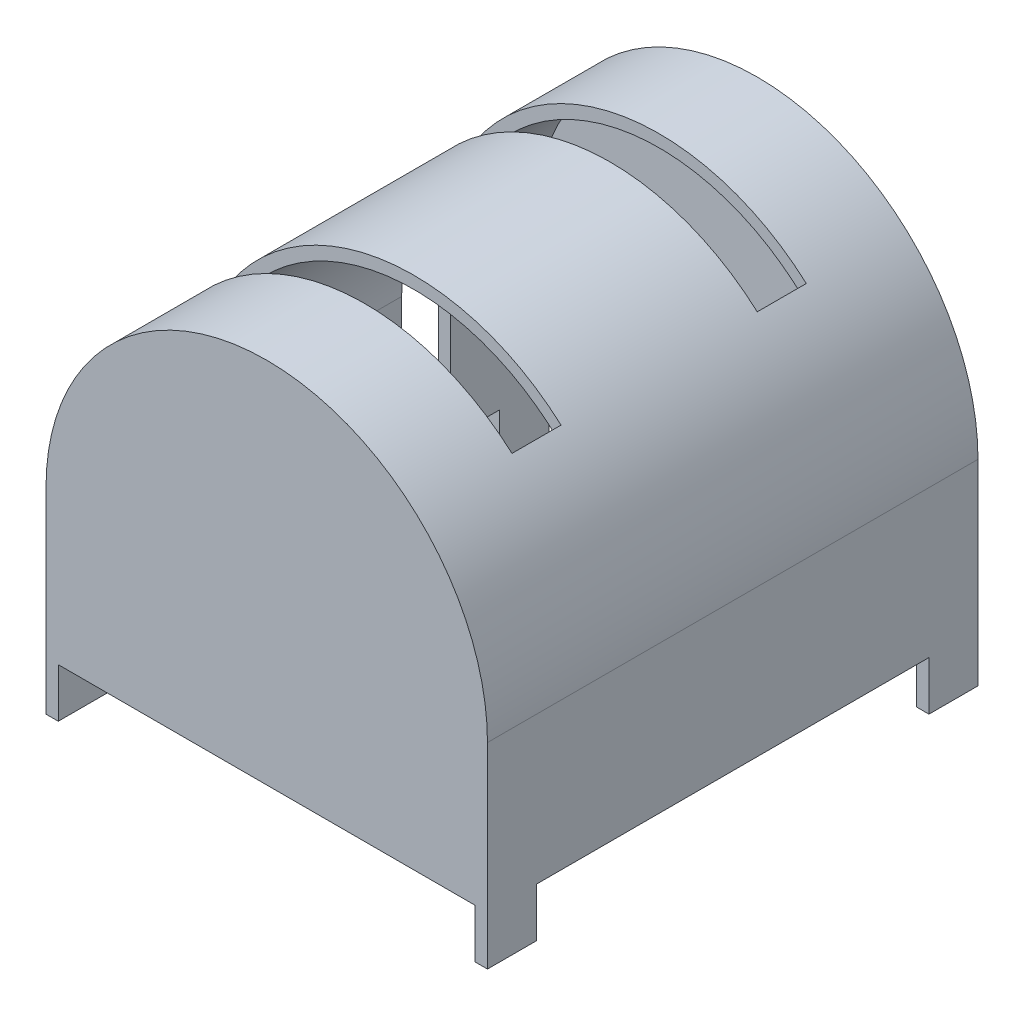
ISO-10303-21;
HEADER;
FILE_DESCRIPTION(('STEP AP214'),'2;1');
FILE_NAME('part.step','',(''),(''),'','','');
FILE_SCHEMA(('AUTOMOTIVE_DESIGN { 1 0 10303 214 1 1 1 1 }'));
ENDSEC;
DATA;
#1=APPLICATION_CONTEXT('core data for automotive mechanical design processes');
#2=APPLICATION_PROTOCOL_DEFINITION('international standard','automotive_design',2000,#1);
#3=PRODUCT_CONTEXT('',#1,'mechanical');
#4=PRODUCT('Part','Part','',(#3));
#5=PRODUCT_RELATED_PRODUCT_CATEGORY('part','',(#4));
#6=PRODUCT_DEFINITION_FORMATION('','',#4);
#7=PRODUCT_DEFINITION_CONTEXT('part definition',#1,'design');
#8=PRODUCT_DEFINITION('design','',#6,#7);
#9=PRODUCT_DEFINITION_SHAPE('','',#8);
#10=(LENGTH_UNIT() NAMED_UNIT(*) SI_UNIT(.MILLI.,.METRE.));
#11=(NAMED_UNIT(*) PLANE_ANGLE_UNIT() SI_UNIT($,.RADIAN.));
#12=(NAMED_UNIT(*) SI_UNIT($,.STERADIAN.) SOLID_ANGLE_UNIT());
#13=UNCERTAINTY_MEASURE_WITH_UNIT(LENGTH_MEASURE(1.E-05),#10,'distance_accuracy_value','');
#14=(GEOMETRIC_REPRESENTATION_CONTEXT(3) GLOBAL_UNCERTAINTY_ASSIGNED_CONTEXT((#13)) GLOBAL_UNIT_ASSIGNED_CONTEXT((#10,
#11,#12)) REPRESENTATION_CONTEXT('',''));
#15=CARTESIAN_POINT('',(0.,0.,0.));
#16=DIRECTION('',(0.,0.,1.));
#17=DIRECTION('',(1.,0.,0.));
#18=AXIS2_PLACEMENT_3D('',#15,#16,#17);
#19=CARTESIAN_POINT('',(0.,0.,0.));
#20=DIRECTION('',(0.,1.,0.));
#21=DIRECTION('',(0.,0.,1.));
#22=AXIS2_PLACEMENT_3D('',#19,#20,#21);
#23=PLANE('',#22);
#24=DIRECTION('',(0.,0.,1.));
#25=VECTOR('',#24,1.);
#26=CARTESIAN_POINT('',(-42.5,0.,-47.5));
#27=LINE('',#26,#25);
#28=CARTESIAN_POINT('',(-42.5,0.,-20.));
#29=VERTEX_POINT('',#28);
#30=CARTESIAN_POINT('',(-42.5,0.,20.));
#31=VERTEX_POINT('',#30);
#32=EDGE_CURVE('E505',#29,#31,#27,.T.);
#33=ORIENTED_EDGE('',*,*,#32,.T.);
#34=DIRECTION('',(1.,0.,0.));
#35=VECTOR('',#34,1.);
#36=CARTESIAN_POINT('',(0.,0.,20.));
#37=LINE('',#36,#35);
#38=CARTESIAN_POINT('',(-45.,0.,20.));
#39=VERTEX_POINT('',#38);
#40=EDGE_CURVE('E643',#39,#31,#37,.T.);
#41=ORIENTED_EDGE('',*,*,#40,.F.);
#42=DIRECTION('',(0.,0.,1.));
#43=VECTOR('',#42,1.);
#44=CARTESIAN_POINT('',(-45.,0.,-50.));
#45=LINE('',#44,#43);
#46=CARTESIAN_POINT('',(-45.,0.,-20.));
#47=VERTEX_POINT('',#46);
#48=EDGE_CURVE('E545',#47,#39,#45,.T.);
#49=ORIENTED_EDGE('',*,*,#48,.F.);
#50=DIRECTION('',(1.,0.,0.));
#51=VECTOR('',#50,1.);
#52=CARTESIAN_POINT('',(0.,0.,-20.));
#53=LINE('',#52,#51);
#54=EDGE_CURVE('E640',#47,#29,#53,.T.);
#55=ORIENTED_EDGE('',*,*,#54,.T.);
#56=EDGE_LOOP('',(#33,#41,#49,#55));
#57=FACE_BOUND('',#56,.T.);
#58=ADVANCED_FACE('F43',(#57),#23,.F.);
#59=DIRECTION('',(1.,0.,0.));
#60=VECTOR('',#59,1.);
#61=CARTESIAN_POINT('',(0.,0.,30.));
#62=LINE('',#61,#60);
#63=CARTESIAN_POINT('',(-45.,0.,30.));
#64=VERTEX_POINT('',#63);
#65=CARTESIAN_POINT('',(-42.5,0.,30.));
#66=VERTEX_POINT('',#65);
#67=EDGE_CURVE('E276',#64,#66,#62,.T.);
#68=ORIENTED_EDGE('',*,*,#67,.T.);
#69=CARTESIAN_POINT('',(-42.5,0.,40.));
#70=VERTEX_POINT('',#69);
#71=EDGE_CURVE('E488',#66,#70,#27,.T.);
#72=ORIENTED_EDGE('',*,*,#71,.T.);
#73=DIRECTION('',(1.,0.,0.));
#74=VECTOR('',#73,1.);
#75=CARTESIAN_POINT('',(-45.,0.,40.));
#76=LINE('',#75,#74);
#77=CARTESIAN_POINT('',(-45.,0.,40.));
#78=VERTEX_POINT('',#77);
#79=EDGE_CURVE('E440',#78,#70,#76,.T.);
#80=ORIENTED_EDGE('',*,*,#79,.F.);
#81=EDGE_CURVE('E529',#64,#78,#45,.T.);
#82=ORIENTED_EDGE('',*,*,#81,.F.);
#83=EDGE_LOOP('',(#68,#72,#80,#82));
#84=FACE_BOUND('',#83,.T.);
#85=ADVANCED_FACE('F585',(#84),#23,.F.);
#86=CARTESIAN_POINT('',(-45.,30.,-50.));
#87=DIRECTION('',(1.,0.,0.));
#88=DIRECTION('',(0.,0.,-1.));
#89=AXIS2_PLACEMENT_3D('',#86,#87,#88);
#90=PLANE('',#89);
#91=ORIENTED_EDGE('',*,*,#48,.T.);
#92=DIRECTION('',(0.,1.,0.));
#93=VECTOR('',#92,1.);
#94=CARTESIAN_POINT('',(-45.,30.,20.));
#95=LINE('',#94,#93);
#96=CARTESIAN_POINT('',(-45.0000000000001,30.,20.));
#97=VERTEX_POINT('',#96);
#98=EDGE_CURVE('E332',#39,#97,#95,.T.);
#99=ORIENTED_EDGE('',*,*,#98,.T.);
#100=DIRECTION('',(0.,0.,1.));
#101=VECTOR('',#100,1.);
#102=CARTESIAN_POINT('',(-45.,30.,-50.));
#103=LINE('',#102,#101);
#104=CARTESIAN_POINT('',(-45.0000000000001,30.,-20.));
#105=VERTEX_POINT('',#104);
#106=EDGE_CURVE('E259',#105,#97,#103,.T.);
#107=ORIENTED_EDGE('',*,*,#106,.F.);
#108=DIRECTION('',(0.,1.,0.));
#109=VECTOR('',#108,1.);
#110=CARTESIAN_POINT('',(-45.,30.,-20.));
#111=LINE('',#110,#109);
#112=EDGE_CURVE('E322',#47,#105,#111,.T.);
#113=ORIENTED_EDGE('',*,*,#112,.F.);
#114=EDGE_LOOP('',(#91,#99,#107,#113));
#115=FACE_BOUND('',#114,.T.);
#116=ADVANCED_FACE('F659',(#115),#90,.F.);
#117=DIRECTION('',(0.,1.,0.));
#118=VECTOR('',#117,1.);
#119=CARTESIAN_POINT('',(-45.,30.,30.));
#120=LINE('',#119,#118);
#121=CARTESIAN_POINT('',(-45.0000000000001,30.,30.));
#122=VERTEX_POINT('',#121);
#123=EDGE_CURVE('E297',#64,#122,#120,.T.);
#124=ORIENTED_EDGE('',*,*,#123,.F.);
#125=ORIENTED_EDGE('',*,*,#81,.T.);
#126=DIRECTION('',(0.,1.,0.));
#127=VECTOR('',#126,1.);
#128=CARTESIAN_POINT('',(-45.,-10.,40.));
#129=LINE('',#128,#127);
#130=CARTESIAN_POINT('',(-45.,-10.,40.));
#131=VERTEX_POINT('',#130);
#132=EDGE_CURVE('E480',#131,#78,#129,.T.);
#133=ORIENTED_EDGE('',*,*,#132,.F.);
#134=DIRECTION('',(0.,0.,-1.));
#135=VECTOR('',#134,1.);
#136=CARTESIAN_POINT('',(-45.,-10.,50.));
#137=LINE('',#136,#135);
#138=CARTESIAN_POINT('',(-45.,-10.,50.));
#139=VERTEX_POINT('',#138);
#140=EDGE_CURVE('E461',#139,#131,#137,.T.);
#141=ORIENTED_EDGE('',*,*,#140,.F.);
#142=DIRECTION('',(0.,-1.,0.));
#143=VECTOR('',#142,1.);
#144=CARTESIAN_POINT('',(-45.,30.,50.));
#145=LINE('',#144,#143);
#146=CARTESIAN_POINT('',(-45.,30.,50.));
#147=VERTEX_POINT('',#146);
#148=EDGE_CURVE('E473',#147,#139,#145,.T.);
#149=ORIENTED_EDGE('',*,*,#148,.F.);
#150=EDGE_CURVE('E535',#122,#147,#103,.T.);
#151=ORIENTED_EDGE('',*,*,#150,.F.);
#152=EDGE_LOOP('',(#124,#125,#133,#141,#149,#151));
#153=FACE_BOUND('',#152,.T.);
#154=ADVANCED_FACE('F603',(#153),#90,.F.);
#155=CARTESIAN_POINT('',(-42.5,30.,-47.5));
#156=DIRECTION('',(1.,0.,0.));
#157=DIRECTION('',(0.,0.,-1.));
#158=AXIS2_PLACEMENT_3D('',#155,#156,#157);
#159=PLANE('',#158);
#160=DIRECTION('',(0.,1.,0.));
#161=VECTOR('',#160,1.);
#162=CARTESIAN_POINT('',(-42.5,30.,20.));
#163=LINE('',#162,#161);
#164=CARTESIAN_POINT('',(-42.5,30.,20.));
#165=VERTEX_POINT('',#164);
#166=EDGE_CURVE('E337',#31,#165,#163,.T.);
#167=ORIENTED_EDGE('',*,*,#166,.F.);
#168=ORIENTED_EDGE('',*,*,#32,.F.);
#169=DIRECTION('',(0.,1.,0.));
#170=VECTOR('',#169,1.);
#171=CARTESIAN_POINT('',(-42.5,30.,-20.));
#172=LINE('',#171,#170);
#173=CARTESIAN_POINT('',(-42.5,30.,-20.));
#174=VERTEX_POINT('',#173);
#175=EDGE_CURVE('E328',#29,#174,#172,.T.);
#176=ORIENTED_EDGE('',*,*,#175,.T.);
#177=DIRECTION('',(0.,0.,1.));
#178=VECTOR('',#177,1.);
#179=CARTESIAN_POINT('',(-42.5,30.,-47.5));
#180=LINE('',#179,#178);
#181=EDGE_CURVE('E494',#174,#165,#180,.T.);
#182=ORIENTED_EDGE('',*,*,#181,.T.);
#183=EDGE_LOOP('',(#167,#168,#176,#182));
#184=FACE_BOUND('',#183,.T.);
#185=ADVANCED_FACE('F653',(#184),#159,.T.);
#186=ORIENTED_EDGE('',*,*,#71,.F.);
#187=DIRECTION('',(0.,1.,0.));
#188=VECTOR('',#187,1.);
#189=CARTESIAN_POINT('',(-42.5,30.,30.));
#190=LINE('',#189,#188);
#191=CARTESIAN_POINT('',(-42.5,30.,30.));
#192=VERTEX_POINT('',#191);
#193=EDGE_CURVE('E303',#66,#192,#190,.T.);
#194=ORIENTED_EDGE('',*,*,#193,.T.);
#195=CARTESIAN_POINT('',(-42.5,29.9999999999997,47.5));
#196=VERTEX_POINT('',#195);
#197=EDGE_CURVE('E495',#192,#196,#180,.T.);
#198=ORIENTED_EDGE('',*,*,#197,.T.);
#199=DIRECTION('',(0.,-1.,0.));
#200=VECTOR('',#199,1.);
#201=CARTESIAN_POINT('',(-42.5,30.,47.5));
#202=LINE('',#201,#200);
#203=CARTESIAN_POINT('',(-42.5,0.,47.5));
#204=VERTEX_POINT('',#203);
#205=EDGE_CURVE('E525',#196,#204,#202,.T.);
#206=ORIENTED_EDGE('',*,*,#205,.T.);
#207=DIRECTION('',(0.,0.,1.));
#208=VECTOR('',#207,1.);
#209=CARTESIAN_POINT('',(-42.5,0.,47.5));
#210=LINE('',#209,#208);
#211=CARTESIAN_POINT('',(-42.5,0.,50.));
#212=VERTEX_POINT('',#211);
#213=EDGE_CURVE('E468',#204,#212,#210,.T.);
#214=ORIENTED_EDGE('',*,*,#213,.T.);
#215=DIRECTION('',(0.,1.,0.));
#216=VECTOR('',#215,1.);
#217=CARTESIAN_POINT('',(-42.5,-10.,50.));
#218=LINE('',#217,#216);
#219=CARTESIAN_POINT('',(-42.5,-10.,50.));
#220=VERTEX_POINT('',#219);
#221=EDGE_CURVE('E484',#220,#212,#218,.T.);
#222=ORIENTED_EDGE('',*,*,#221,.F.);
#223=DIRECTION('',(0.,0.,1.));
#224=VECTOR('',#223,1.);
#225=CARTESIAN_POINT('',(-42.5,-10.,40.));
#226=LINE('',#225,#224);
#227=CARTESIAN_POINT('',(-42.5,-10.,40.));
#228=VERTEX_POINT('',#227);
#229=EDGE_CURVE('E454',#228,#220,#226,.T.);
#230=ORIENTED_EDGE('',*,*,#229,.F.);
#231=DIRECTION('',(0.,1.,0.));
#232=VECTOR('',#231,1.);
#233=CARTESIAN_POINT('',(-42.5,-10.,40.));
#234=LINE('',#233,#232);
#235=EDGE_CURVE('E467',#228,#70,#234,.T.);
#236=ORIENTED_EDGE('',*,*,#235,.T.);
#237=EDGE_LOOP('',(#186,#194,#198,#206,#214,#222,#230,#236));
#238=FACE_BOUND('',#237,.T.);
#239=ADVANCED_FACE('F594',(#238),#159,.T.);
#240=CARTESIAN_POINT('',(0.,30.,-57.6639275532449));
#241=DIRECTION('',(0.,0.,-1.));
#242=DIRECTION('',(-1.,0.,0.));
#243=AXIS2_PLACEMENT_3D('',#240,#241,#242);
#244=CYLINDRICAL_SURFACE('',#243,42.5);
#245=CARTESIAN_POINT('',(0.,30.,-20.));
#246=DIRECTION('',(0.,0.,-1.));
#247=DIRECTION('',(-1.,0.,0.));
#248=AXIS2_PLACEMENT_3D('',#245,#246,#247);
#249=CIRCLE('',#248,42.5);
#250=CARTESIAN_POINT('',(30.,60.1039864469808,-20.));
#251=VERTEX_POINT('',#250);
#252=EDGE_CURVE('E325',#251,#174,#249,.F.);
#253=ORIENTED_EDGE('',*,*,#252,.F.);
#254=DIRECTION('',(0.,0.,-1.));
#255=VECTOR('',#254,1.);
#256=CARTESIAN_POINT('',(30.,60.1039864469808,-57.6639275532449));
#257=LINE('',#256,#255);
#258=CARTESIAN_POINT('',(30.,60.1039864469807,-30.));
#259=VERTEX_POINT('',#258);
#260=EDGE_CURVE('E318',#251,#259,#257,.T.);
#261=ORIENTED_EDGE('',*,*,#260,.T.);
#262=CARTESIAN_POINT('',(0.,30.,-30.));
#263=DIRECTION('',(0.,0.,-1.));
#264=DIRECTION('',(-1.,0.,0.));
#265=AXIS2_PLACEMENT_3D('',#262,#263,#264);
#266=CIRCLE('',#265,42.5);
#267=CARTESIAN_POINT('',(-42.5,30.,-30.));
#268=VERTEX_POINT('',#267);
#269=EDGE_CURVE('E311',#259,#268,#266,.F.);
#270=ORIENTED_EDGE('',*,*,#269,.T.);
#271=CARTESIAN_POINT('',(-42.5,30.,-47.5));
#272=VERTEX_POINT('',#271);
#273=EDGE_CURVE('E489',#272,#268,#180,.T.);
#274=ORIENTED_EDGE('',*,*,#273,.F.);
#275=CARTESIAN_POINT('',(0.,30.,-47.5));
#276=DIRECTION('',(0.,0.,-1.));
#277=DIRECTION('',(-1.,0.,0.));
#278=AXIS2_PLACEMENT_3D('',#275,#276,#277);
#279=CIRCLE('',#278,42.5);
#280=CARTESIAN_POINT('',(42.5,30.,-47.5));
#281=VERTEX_POINT('',#280);
#282=EDGE_CURVE('E340',#272,#281,#279,.T.);
#283=ORIENTED_EDGE('',*,*,#282,.T.);
#284=DIRECTION('',(0.,0.,-1.));
#285=VECTOR('',#284,1.);
#286=CARTESIAN_POINT('',(42.5,30.,-47.5));
#287=LINE('',#286,#285);
#288=CARTESIAN_POINT('',(42.5,30.,47.5));
#289=VERTEX_POINT('',#288);
#290=EDGE_CURVE('E493',#289,#281,#287,.T.);
#291=ORIENTED_EDGE('',*,*,#290,.F.);
#292=CARTESIAN_POINT('',(0.,30.,47.5));
#293=DIRECTION('',(0.,0.,-1.));
#294=DIRECTION('',(-1.,0.,0.));
#295=AXIS2_PLACEMENT_3D('',#292,#293,#294);
#296=CIRCLE('',#295,42.5);
#297=EDGE_CURVE('E343',#196,#289,#296,.T.);
#298=ORIENTED_EDGE('',*,*,#297,.F.);
#299=ORIENTED_EDGE('',*,*,#197,.F.);
#300=CARTESIAN_POINT('',(0.,30.,30.));
#301=DIRECTION('',(0.,0.,-1.));
#302=DIRECTION('',(-1.,0.,0.));
#303=AXIS2_PLACEMENT_3D('',#300,#301,#302);
#304=CIRCLE('',#303,42.5);
#305=CARTESIAN_POINT('',(30.,60.1039864469808,30.));
#306=VERTEX_POINT('',#305);
#307=EDGE_CURVE('E300',#306,#192,#304,.F.);
#308=ORIENTED_EDGE('',*,*,#307,.F.);
#309=DIRECTION('',(0.,0.,-1.));
#310=VECTOR('',#309,1.);
#311=CARTESIAN_POINT('',(30.,60.1039864469808,-57.6639275532449));
#312=LINE('',#311,#310);
#313=CARTESIAN_POINT('',(30.,60.1039864469808,20.));
#314=VERTEX_POINT('',#313);
#315=EDGE_CURVE('E294',#306,#314,#312,.T.);
#316=ORIENTED_EDGE('',*,*,#315,.T.);
#317=CARTESIAN_POINT('',(0.,30.,20.));
#318=DIRECTION('',(0.,0.,-1.));
#319=DIRECTION('',(-1.,0.,0.));
#320=AXIS2_PLACEMENT_3D('',#317,#318,#319);
#321=CIRCLE('',#320,42.5);
#322=EDGE_CURVE('E274',#314,#165,#321,.F.);
#323=ORIENTED_EDGE('',*,*,#322,.T.);
#324=ORIENTED_EDGE('',*,*,#181,.F.);
#325=EDGE_LOOP('',(#253,#261,#270,#274,#283,#291,#298,#299,#308,#316,#323,#324));
#326=FACE_BOUND('',#325,.T.);
#327=ADVANCED_FACE('F681',(#326),#244,.F.);
#328=CARTESIAN_POINT('',(0.,30.,-57.6639275532449));
#329=DIRECTION('',(0.,0.,-1.));
#330=DIRECTION('',(-1.,0.,0.));
#331=AXIS2_PLACEMENT_3D('',#328,#329,#330);
#332=CYLINDRICAL_SURFACE('',#331,45.0000000000001);
#333=DIRECTION('',(0.,0.,-1.));
#334=VECTOR('',#333,1.);
#335=CARTESIAN_POINT('',(30.,63.5410196624969,-57.6639275532449));
#336=LINE('',#335,#334);
#337=CARTESIAN_POINT('',(30.,63.5410196624969,-30.));
#338=VERTEX_POINT('',#337);
#339=CARTESIAN_POINT('',(30.,63.5410196624969,-20.));
#340=VERTEX_POINT('',#339);
#341=EDGE_CURVE('E11',#338,#340,#336,.F.);
#342=ORIENTED_EDGE('',*,*,#341,.T.);
#343=CARTESIAN_POINT('',(0.,30.,-20.));
#344=DIRECTION('',(0.,0.,-1.));
#345=DIRECTION('',(-1.,0.,0.));
#346=AXIS2_PLACEMENT_3D('',#343,#344,#345);
#347=CIRCLE('',#346,45.0000000000001);
#348=EDGE_CURVE('E567',#105,#340,#347,.T.);
#349=ORIENTED_EDGE('',*,*,#348,.F.);
#350=ORIENTED_EDGE('',*,*,#106,.T.);
#351=CARTESIAN_POINT('',(0.,30.,20.));
#352=DIRECTION('',(0.,0.,-1.));
#353=DIRECTION('',(-1.,0.,0.));
#354=AXIS2_PLACEMENT_3D('',#351,#352,#353);
#355=CIRCLE('',#354,45.0000000000001);
#356=CARTESIAN_POINT('',(30.,63.5410196624969,20.));
#357=VERTEX_POINT('',#356);
#358=EDGE_CURVE('E254',#97,#357,#355,.T.);
#359=ORIENTED_EDGE('',*,*,#358,.T.);
#360=DIRECTION('',(0.,0.,-1.));
#361=VECTOR('',#360,1.);
#362=CARTESIAN_POINT('',(30.,63.5410196624969,-57.6639275532449));
#363=LINE('',#362,#361);
#364=CARTESIAN_POINT('',(30.,63.5410196624969,30.));
#365=VERTEX_POINT('',#364);
#366=EDGE_CURVE('E52',#357,#365,#363,.F.);
#367=ORIENTED_EDGE('',*,*,#366,.T.);
#368=CARTESIAN_POINT('',(0.,30.,30.));
#369=DIRECTION('',(0.,0.,-1.));
#370=DIRECTION('',(-1.,0.,0.));
#371=AXIS2_PLACEMENT_3D('',#368,#369,#370);
#372=CIRCLE('',#371,45.0000000000001);
#373=EDGE_CURVE('E59',#122,#365,#372,.T.);
#374=ORIENTED_EDGE('',*,*,#373,.F.);
#375=ORIENTED_EDGE('',*,*,#150,.T.);
#376=CARTESIAN_POINT('',(0.,30.,50.));
#377=DIRECTION('',(0.,0.,-1.));
#378=DIRECTION('',(-1.,0.,0.));
#379=AXIS2_PLACEMENT_3D('',#376,#377,#378);
#380=CIRCLE('',#379,45.0000000000001);
#381=CARTESIAN_POINT('',(45.0000000000001,30.,50.));
#382=VERTEX_POINT('',#381);
#383=EDGE_CURVE('E346',#147,#382,#380,.T.);
#384=ORIENTED_EDGE('',*,*,#383,.T.);
#385=DIRECTION('',(0.,0.,-1.));
#386=VECTOR('',#385,1.);
#387=CARTESIAN_POINT('',(45.,30.,-50.));
#388=LINE('',#387,#386);
#389=CARTESIAN_POINT('',(45.,30.,-50.));
#390=VERTEX_POINT('',#389);
#391=EDGE_CURVE('E534',#382,#390,#388,.T.);
#392=ORIENTED_EDGE('',*,*,#391,.T.);
#393=CARTESIAN_POINT('',(0.,30.,-50.));
#394=DIRECTION('',(0.,0.,-1.));
#395=DIRECTION('',(-1.,0.,0.));
#396=AXIS2_PLACEMENT_3D('',#393,#394,#395);
#397=CIRCLE('',#396,45.);
#398=CARTESIAN_POINT('',(-45.,29.9999999999997,-50.));
#399=VERTEX_POINT('',#398);
#400=EDGE_CURVE('E350',#399,#390,#397,.T.);
#401=ORIENTED_EDGE('',*,*,#400,.F.);
#402=CARTESIAN_POINT('',(-45.0000000000001,30.,-30.));
#403=VERTEX_POINT('',#402);
#404=EDGE_CURVE('E530',#399,#403,#103,.T.);
#405=ORIENTED_EDGE('',*,*,#404,.T.);
#406=CARTESIAN_POINT('',(0.,30.,-30.));
#407=DIRECTION('',(0.,0.,-1.));
#408=DIRECTION('',(-1.,0.,0.));
#409=AXIS2_PLACEMENT_3D('',#406,#407,#408);
#410=CIRCLE('',#409,45.0000000000001);
#411=EDGE_CURVE('E472',#403,#338,#410,.T.);
#412=ORIENTED_EDGE('',*,*,#411,.T.);
#413=EDGE_LOOP('',(#342,#349,#350,#359,#367,#374,#375,#384,#392,#401,#405,#412));
#414=FACE_BOUND('',#413,.T.);
#415=ADVANCED_FACE('F256',(#414),#332,.T.);
#416=DIRECTION('',(-1.,0.,0.));
#417=VECTOR('',#416,1.);
#418=CARTESIAN_POINT('',(45.0000000000001,0.,-40.));
#419=LINE('',#418,#417);
#420=CARTESIAN_POINT('',(45.,0.,-40.));
#421=VERTEX_POINT('',#420);
#422=CARTESIAN_POINT('',(42.5,0.,-40.));
#423=VERTEX_POINT('',#422);
#424=EDGE_CURVE('E67',#421,#423,#419,.T.);
#425=ORIENTED_EDGE('',*,*,#424,.F.);
#426=DIRECTION('',(0.,0.,-1.));
#427=VECTOR('',#426,1.);
#428=CARTESIAN_POINT('',(45.,0.,-50.));
#429=LINE('',#428,#427);
#430=CARTESIAN_POINT('',(45.0000000000001,0.,40.));
#431=VERTEX_POINT('',#430);
#432=EDGE_CURVE('E549',#431,#421,#429,.T.);
#433=ORIENTED_EDGE('',*,*,#432,.F.);
#434=DIRECTION('',(1.,0.,0.));
#435=VECTOR('',#434,1.);
#436=CARTESIAN_POINT('',(45.0000000000001,0.,40.));
#437=LINE('',#436,#435);
#438=CARTESIAN_POINT('',(42.5,0.,40.));
#439=VERTEX_POINT('',#438);
#440=EDGE_CURVE('E435',#439,#431,#437,.T.);
#441=ORIENTED_EDGE('',*,*,#440,.F.);
#442=DIRECTION('',(0.,0.,-1.));
#443=VECTOR('',#442,1.);
#444=CARTESIAN_POINT('',(42.5,0.,-47.5));
#445=LINE('',#444,#443);
#446=EDGE_CURVE('E509',#439,#423,#445,.T.);
#447=ORIENTED_EDGE('',*,*,#446,.T.);
#448=EDGE_LOOP('',(#425,#433,#441,#447));
#449=FACE_BOUND('',#448,.T.);
#450=ADVANCED_FACE('F670',(#449),#23,.F.);
#451=DIRECTION('',(0.,0.,-1.));
#452=VECTOR('',#451,1.);
#453=CARTESIAN_POINT('',(42.5,0.,-40.));
#454=LINE('',#453,#452);
#455=CARTESIAN_POINT('',(42.5,0.,-47.5));
#456=VERTEX_POINT('',#455);
#457=CARTESIAN_POINT('',(42.5,0.,-50.));
#458=VERTEX_POINT('',#457);
#459=EDGE_CURVE('E367',#456,#458,#454,.T.);
#460=ORIENTED_EDGE('',*,*,#459,.F.);
#461=DIRECTION('',(-1.,0.,0.));
#462=VECTOR('',#461,1.);
#463=CARTESIAN_POINT('',(-42.5,0.,-47.5));
#464=LINE('',#463,#462);
#465=CARTESIAN_POINT('',(-42.5,0.,-47.5));
#466=VERTEX_POINT('',#465);
#467=EDGE_CURVE('E512',#456,#466,#464,.T.);
#468=ORIENTED_EDGE('',*,*,#467,.T.);
#469=DIRECTION('',(0.,0.,1.));
#470=VECTOR('',#469,1.);
#471=CARTESIAN_POINT('',(-42.5,0.,-47.5));
#472=LINE('',#471,#470);
#473=CARTESIAN_POINT('',(-42.5,0.,-50.));
#474=VERTEX_POINT('',#473);
#475=EDGE_CURVE('E402',#474,#466,#472,.T.);
#476=ORIENTED_EDGE('',*,*,#475,.F.);
#477=DIRECTION('',(-1.,0.,0.));
#478=VECTOR('',#477,1.);
#479=CARTESIAN_POINT('',(-45.,0.,-50.));
#480=LINE('',#479,#478);
#481=EDGE_CURVE('E552',#458,#474,#480,.T.);
#482=ORIENTED_EDGE('',*,*,#481,.F.);
#483=EDGE_LOOP('',(#460,#468,#476,#482));
#484=FACE_BOUND('',#483,.T.);
#485=ADVANCED_FACE('F666',(#484),#23,.F.);
#486=CARTESIAN_POINT('',(-42.5,0.,-40.));
#487=VERTEX_POINT('',#486);
#488=CARTESIAN_POINT('',(-42.5,0.,-30.));
#489=VERTEX_POINT('',#488);
#490=EDGE_CURVE('E500',#487,#489,#27,.T.);
#491=ORIENTED_EDGE('',*,*,#490,.T.);
#492=DIRECTION('',(1.,0.,0.));
#493=VECTOR('',#492,1.);
#494=CARTESIAN_POINT('',(0.,0.,-30.));
#495=LINE('',#494,#493);
#496=CARTESIAN_POINT('',(-45.,0.,-30.));
#497=VERTEX_POINT('',#496);
#498=EDGE_CURVE('E283',#497,#489,#495,.T.);
#499=ORIENTED_EDGE('',*,*,#498,.F.);
#500=CARTESIAN_POINT('',(-45.,0.,-40.));
#501=VERTEX_POINT('',#500);
#502=EDGE_CURVE('E540',#501,#497,#45,.T.);
#503=ORIENTED_EDGE('',*,*,#502,.F.);
#504=DIRECTION('',(-1.,0.,0.));
#505=VECTOR('',#504,1.);
#506=CARTESIAN_POINT('',(-42.5,0.,-40.));
#507=LINE('',#506,#505);
#508=EDGE_CURVE('E398',#487,#501,#507,.T.);
#509=ORIENTED_EDGE('',*,*,#508,.F.);
#510=EDGE_LOOP('',(#491,#499,#503,#509));
#511=FACE_BOUND('',#510,.T.);
#512=ADVANCED_FACE('F636',(#511),#23,.F.);
#513=DIRECTION('',(0.,0.,-1.));
#514=VECTOR('',#513,1.);
#515=CARTESIAN_POINT('',(42.5,0.,47.5));
#516=LINE('',#515,#514);
#517=CARTESIAN_POINT('',(42.5,0.,50.));
#518=VERTEX_POINT('',#517);
#519=CARTESIAN_POINT('',(42.5,0.,47.5));
#520=VERTEX_POINT('',#519);
#521=EDGE_CURVE('E431',#518,#520,#516,.T.);
#522=ORIENTED_EDGE('',*,*,#521,.F.);
#523=DIRECTION('',(1.,0.,0.));
#524=VECTOR('',#523,1.);
#525=CARTESIAN_POINT('',(-45.,0.,50.));
#526=LINE('',#525,#524);
#527=EDGE_CURVE('E544',#212,#518,#526,.T.);
#528=ORIENTED_EDGE('',*,*,#527,.F.);
#529=ORIENTED_EDGE('',*,*,#213,.F.);
#530=DIRECTION('',(1.,0.,0.));
#531=VECTOR('',#530,1.);
#532=CARTESIAN_POINT('',(-42.5,0.,47.5));
#533=LINE('',#532,#531);
#534=EDGE_CURVE('E504',#204,#520,#533,.T.);
#535=ORIENTED_EDGE('',*,*,#534,.T.);
#536=EDGE_LOOP('',(#522,#528,#529,#535));
#537=FACE_BOUND('',#536,.T.);
#538=ADVANCED_FACE('F668',(#537),#23,.F.);
#539=ORIENTED_EDGE('',*,*,#502,.T.);
#540=DIRECTION('',(0.,1.,0.));
#541=VECTOR('',#540,1.);
#542=CARTESIAN_POINT('',(-45.,30.,-30.));
#543=LINE('',#542,#541);
#544=EDGE_CURVE('E307',#497,#403,#543,.T.);
#545=ORIENTED_EDGE('',*,*,#544,.T.);
#546=ORIENTED_EDGE('',*,*,#404,.F.);
#547=DIRECTION('',(0.,-1.,0.));
#548=VECTOR('',#547,1.);
#549=CARTESIAN_POINT('',(-45.,30.,-50.));
#550=LINE('',#549,#548);
#551=CARTESIAN_POINT('',(-45.,-10.,-50.));
#552=VERTEX_POINT('',#551);
#553=EDGE_CURVE('E539',#399,#552,#550,.T.);
#554=ORIENTED_EDGE('',*,*,#553,.T.);
#555=DIRECTION('',(0.,0.,-1.));
#556=VECTOR('',#555,1.);
#557=CARTESIAN_POINT('',(-45.,-10.,-40.));
#558=LINE('',#557,#556);
#559=CARTESIAN_POINT('',(-45.,-10.,-40.));
#560=VERTEX_POINT('',#559);
#561=EDGE_CURVE('E410',#560,#552,#558,.T.);
#562=ORIENTED_EDGE('',*,*,#561,.F.);
#563=DIRECTION('',(0.,1.,0.));
#564=VECTOR('',#563,1.);
#565=CARTESIAN_POINT('',(-45.,-10.,-40.));
#566=LINE('',#565,#564);
#567=EDGE_CURVE('E389',#560,#501,#566,.T.);
#568=ORIENTED_EDGE('',*,*,#567,.T.);
#569=EDGE_LOOP('',(#539,#545,#546,#554,#562,#568));
#570=FACE_BOUND('',#569,.T.);
#571=ADVANCED_FACE('F45',(#570),#90,.F.);
#572=CARTESIAN_POINT('',(-45.,30.,50.));
#573=DIRECTION('',(0.,0.,-1.));
#574=DIRECTION('',(-1.,0.,0.));
#575=AXIS2_PLACEMENT_3D('',#572,#573,#574);
#576=PLANE('',#575);
#577=ORIENTED_EDGE('',*,*,#148,.T.);
#578=DIRECTION('',(-1.,0.,0.));
#579=VECTOR('',#578,1.);
#580=CARTESIAN_POINT('',(-42.5,-10.,50.));
#581=LINE('',#580,#579);
#582=EDGE_CURVE('E457',#220,#139,#581,.T.);
#583=ORIENTED_EDGE('',*,*,#582,.F.);
#584=ORIENTED_EDGE('',*,*,#221,.T.);
#585=ORIENTED_EDGE('',*,*,#527,.T.);
#586=DIRECTION('',(0.,1.,0.));
#587=VECTOR('',#586,1.);
#588=CARTESIAN_POINT('',(42.5,-10.,50.));
#589=LINE('',#588,#587);
#590=CARTESIAN_POINT('',(42.5,-10.,50.));
#591=VERTEX_POINT('',#590);
#592=EDGE_CURVE('E426',#591,#518,#589,.T.);
#593=ORIENTED_EDGE('',*,*,#592,.F.);
#594=DIRECTION('',(-1.,0.,0.));
#595=VECTOR('',#594,1.);
#596=CARTESIAN_POINT('',(42.5,-10.,50.));
#597=LINE('',#596,#595);
#598=CARTESIAN_POINT('',(45.0000000000001,-10.,50.));
#599=VERTEX_POINT('',#598);
#600=EDGE_CURVE('E430',#599,#591,#597,.T.);
#601=ORIENTED_EDGE('',*,*,#600,.F.);
#602=DIRECTION('',(0.,-1.,0.));
#603=VECTOR('',#602,1.);
#604=CARTESIAN_POINT('',(45.0000000000001,30.,50.));
#605=LINE('',#604,#603);
#606=EDGE_CURVE('E560',#382,#599,#605,.T.);
#607=ORIENTED_EDGE('',*,*,#606,.F.);
#608=ORIENTED_EDGE('',*,*,#383,.F.);
#609=EDGE_LOOP('',(#577,#583,#584,#585,#593,#601,#607,#608));
#610=FACE_BOUND('',#609,.T.);
#611=ADVANCED_FACE('F608',(#610),#576,.F.);
#612=CARTESIAN_POINT('',(45.,30.,-50.));
#613=DIRECTION('',(-1.,0.,0.));
#614=DIRECTION('',(0.,0.,1.));
#615=AXIS2_PLACEMENT_3D('',#612,#613,#614);
#616=PLANE('',#615);
#617=ORIENTED_EDGE('',*,*,#606,.T.);
#618=DIRECTION('',(0.,0.,1.));
#619=VECTOR('',#618,1.);
#620=CARTESIAN_POINT('',(45.0000000000001,-10.,50.));
#621=LINE('',#620,#619);
#622=CARTESIAN_POINT('',(45.0000000000001,-10.,40.));
#623=VERTEX_POINT('',#622);
#624=EDGE_CURVE('E444',#623,#599,#621,.T.);
#625=ORIENTED_EDGE('',*,*,#624,.F.);
#626=DIRECTION('',(0.,1.,0.));
#627=VECTOR('',#626,1.);
#628=CARTESIAN_POINT('',(45.0000000000001,-10.,40.));
#629=LINE('',#628,#627);
#630=EDGE_CURVE('E422',#623,#431,#629,.T.);
#631=ORIENTED_EDGE('',*,*,#630,.T.);
#632=ORIENTED_EDGE('',*,*,#432,.T.);
#633=DIRECTION('',(0.,1.,0.));
#634=VECTOR('',#633,1.);
#635=CARTESIAN_POINT('',(45.0000000000001,-10.,-40.));
#636=LINE('',#635,#634);
#637=CARTESIAN_POINT('',(45.0000000000001,-10.,-40.));
#638=VERTEX_POINT('',#637);
#639=EDGE_CURVE('E354',#638,#421,#636,.T.);
#640=ORIENTED_EDGE('',*,*,#639,.F.);
#641=DIRECTION('',(0.,0.,1.));
#642=VECTOR('',#641,1.);
#643=CARTESIAN_POINT('',(45.,-10.,-50.));
#644=LINE('',#643,#642);
#645=CARTESIAN_POINT('',(45.,-10.,-50.));
#646=VERTEX_POINT('',#645);
#647=EDGE_CURVE('E380',#646,#638,#644,.T.);
#648=ORIENTED_EDGE('',*,*,#647,.F.);
#649=DIRECTION('',(0.,-1.,0.));
#650=VECTOR('',#649,1.);
#651=CARTESIAN_POINT('',(45.,30.,-50.));
#652=LINE('',#651,#650);
#653=EDGE_CURVE('E557',#390,#646,#652,.T.);
#654=ORIENTED_EDGE('',*,*,#653,.F.);
#655=ORIENTED_EDGE('',*,*,#391,.F.);
#656=EDGE_LOOP('',(#617,#625,#631,#632,#640,#648,#654,#655));
#657=FACE_BOUND('',#656,.T.);
#658=ADVANCED_FACE('F614',(#657),#616,.F.);
#659=CARTESIAN_POINT('',(-45.,30.,-50.));
#660=DIRECTION('',(0.,0.,1.));
#661=DIRECTION('',(1.,0.,0.));
#662=AXIS2_PLACEMENT_3D('',#659,#660,#661);
#663=PLANE('',#662);
#664=ORIENTED_EDGE('',*,*,#653,.T.);
#665=DIRECTION('',(1.,0.,0.));
#666=VECTOR('',#665,1.);
#667=CARTESIAN_POINT('',(42.5,-10.,-50.));
#668=LINE('',#667,#666);
#669=CARTESIAN_POINT('',(42.5,-10.,-50.));
#670=VERTEX_POINT('',#669);
#671=EDGE_CURVE('E371',#670,#646,#668,.T.);
#672=ORIENTED_EDGE('',*,*,#671,.F.);
#673=DIRECTION('',(0.,1.,0.));
#674=VECTOR('',#673,1.);
#675=CARTESIAN_POINT('',(42.5,-10.,-50.));
#676=LINE('',#675,#674);
#677=EDGE_CURVE('E362',#670,#458,#676,.T.);
#678=ORIENTED_EDGE('',*,*,#677,.T.);
#679=ORIENTED_EDGE('',*,*,#481,.T.);
#680=DIRECTION('',(0.,1.,0.));
#681=VECTOR('',#680,1.);
#682=CARTESIAN_POINT('',(-42.5,-10.,-50.));
#683=LINE('',#682,#681);
#684=CARTESIAN_POINT('',(-42.5,-10.,-50.));
#685=VERTEX_POINT('',#684);
#686=EDGE_CURVE('E393',#685,#474,#683,.T.);
#687=ORIENTED_EDGE('',*,*,#686,.F.);
#688=DIRECTION('',(1.,0.,0.));
#689=VECTOR('',#688,1.);
#690=CARTESIAN_POINT('',(-45.,-10.,-50.));
#691=LINE('',#690,#689);
#692=EDGE_CURVE('E397',#552,#685,#691,.T.);
#693=ORIENTED_EDGE('',*,*,#692,.F.);
#694=ORIENTED_EDGE('',*,*,#553,.F.);
#695=ORIENTED_EDGE('',*,*,#400,.T.);
#696=EDGE_LOOP('',(#664,#672,#678,#679,#687,#693,#694,#695));
#697=FACE_BOUND('',#696,.T.);
#698=ADVANCED_FACE('F619',(#697),#663,.F.);
#699=DIRECTION('',(0.,1.,0.));
#700=VECTOR('',#699,1.);
#701=CARTESIAN_POINT('',(-42.5,30.,-30.));
#702=LINE('',#701,#700);
#703=EDGE_CURVE('E315',#489,#268,#702,.T.);
#704=ORIENTED_EDGE('',*,*,#703,.F.);
#705=ORIENTED_EDGE('',*,*,#490,.F.);
#706=DIRECTION('',(0.,1.,0.));
#707=VECTOR('',#706,1.);
#708=CARTESIAN_POINT('',(-42.5,-10.,-40.));
#709=LINE('',#708,#707);
#710=CARTESIAN_POINT('',(-42.5,-10.,-40.));
#711=VERTEX_POINT('',#710);
#712=EDGE_CURVE('E374',#711,#487,#709,.T.);
#713=ORIENTED_EDGE('',*,*,#712,.F.);
#714=DIRECTION('',(0.,0.,1.));
#715=VECTOR('',#714,1.);
#716=CARTESIAN_POINT('',(-42.5,-10.,-50.));
#717=LINE('',#716,#715);
#718=EDGE_CURVE('E403',#685,#711,#717,.T.);
#719=ORIENTED_EDGE('',*,*,#718,.F.);
#720=ORIENTED_EDGE('',*,*,#686,.T.);
#721=ORIENTED_EDGE('',*,*,#475,.T.);
#722=DIRECTION('',(0.,-1.,0.));
#723=VECTOR('',#722,1.);
#724=CARTESIAN_POINT('',(-42.5,30.,-47.5));
#725=LINE('',#724,#723);
#726=EDGE_CURVE('E499',#272,#466,#725,.T.);
#727=ORIENTED_EDGE('',*,*,#726,.F.);
#728=ORIENTED_EDGE('',*,*,#273,.T.);
#729=EDGE_LOOP('',(#704,#705,#713,#719,#720,#721,#727,#728));
#730=FACE_BOUND('',#729,.T.);
#731=ADVANCED_FACE('F712',(#730),#159,.T.);
#732=CARTESIAN_POINT('',(-42.5,30.,47.5));
#733=DIRECTION('',(0.,0.,-1.));
#734=DIRECTION('',(-1.,0.,0.));
#735=AXIS2_PLACEMENT_3D('',#732,#733,#734);
#736=PLANE('',#735);
#737=ORIENTED_EDGE('',*,*,#534,.F.);
#738=ORIENTED_EDGE('',*,*,#205,.F.);
#739=ORIENTED_EDGE('',*,*,#297,.T.);
#740=DIRECTION('',(0.,-1.,0.));
#741=VECTOR('',#740,1.);
#742=CARTESIAN_POINT('',(42.5,30.,47.5));
#743=LINE('',#742,#741);
#744=EDGE_CURVE('E522',#289,#520,#743,.T.);
#745=ORIENTED_EDGE('',*,*,#744,.T.);
#746=EDGE_LOOP('',(#737,#738,#739,#745));
#747=FACE_BOUND('',#746,.T.);
#748=ADVANCED_FACE('F728',(#747),#736,.T.);
#749=CARTESIAN_POINT('',(42.5,30.,-47.5));
#750=DIRECTION('',(-1.,0.,0.));
#751=DIRECTION('',(0.,0.,1.));
#752=AXIS2_PLACEMENT_3D('',#749,#750,#751);
#753=PLANE('',#752);
#754=ORIENTED_EDGE('',*,*,#446,.F.);
#755=DIRECTION('',(0.,1.,0.));
#756=VECTOR('',#755,1.);
#757=CARTESIAN_POINT('',(42.5,-10.,40.));
#758=LINE('',#757,#756);
#759=CARTESIAN_POINT('',(42.5,-10.,40.));
#760=VERTEX_POINT('',#759);
#761=EDGE_CURVE('E407',#760,#439,#758,.T.);
#762=ORIENTED_EDGE('',*,*,#761,.F.);
#763=DIRECTION('',(0.,0.,-1.));
#764=VECTOR('',#763,1.);
#765=CARTESIAN_POINT('',(42.5,-10.,40.));
#766=LINE('',#765,#764);
#767=EDGE_CURVE('E436',#591,#760,#766,.T.);
#768=ORIENTED_EDGE('',*,*,#767,.F.);
#769=ORIENTED_EDGE('',*,*,#592,.T.);
#770=ORIENTED_EDGE('',*,*,#521,.T.);
#771=ORIENTED_EDGE('',*,*,#744,.F.);
#772=ORIENTED_EDGE('',*,*,#290,.T.);
#773=DIRECTION('',(0.,-1.,0.));
#774=VECTOR('',#773,1.);
#775=CARTESIAN_POINT('',(42.5,30.,-47.5));
#776=LINE('',#775,#774);
#777=EDGE_CURVE('E518',#281,#456,#776,.T.);
#778=ORIENTED_EDGE('',*,*,#777,.T.);
#779=ORIENTED_EDGE('',*,*,#459,.T.);
#780=ORIENTED_EDGE('',*,*,#677,.F.);
#781=DIRECTION('',(0.,0.,-1.));
#782=VECTOR('',#781,1.);
#783=CARTESIAN_POINT('',(42.5,-10.,-40.));
#784=LINE('',#783,#782);
#785=CARTESIAN_POINT('',(42.5,-10.,-40.));
#786=VERTEX_POINT('',#785);
#787=EDGE_CURVE('E366',#786,#670,#784,.T.);
#788=ORIENTED_EDGE('',*,*,#787,.F.);
#789=DIRECTION('',(0.,1.,0.));
#790=VECTOR('',#789,1.);
#791=CARTESIAN_POINT('',(42.5,-10.,-40.));
#792=LINE('',#791,#790);
#793=EDGE_CURVE('E358',#786,#423,#792,.T.);
#794=ORIENTED_EDGE('',*,*,#793,.T.);
#795=EDGE_LOOP('',(#754,#762,#768,#769,#770,#771,#772,#778,#779,#780,#788,#794));
#796=FACE_BOUND('',#795,.T.);
#797=ADVANCED_FACE('F691',(#796),#753,.T.);
#798=CARTESIAN_POINT('',(-42.5,30.,-47.5));
#799=DIRECTION('',(0.,0.,1.));
#800=DIRECTION('',(1.,0.,0.));
#801=AXIS2_PLACEMENT_3D('',#798,#799,#800);
#802=PLANE('',#801);
#803=ORIENTED_EDGE('',*,*,#467,.F.);
#804=ORIENTED_EDGE('',*,*,#777,.F.);
#805=ORIENTED_EDGE('',*,*,#282,.F.);
#806=ORIENTED_EDGE('',*,*,#726,.T.);
#807=EDGE_LOOP('',(#803,#804,#805,#806));
#808=FACE_BOUND('',#807,.T.);
#809=ADVANCED_FACE('F731',(#808),#802,.T.);
#810=CARTESIAN_POINT('',(-45.,-10.,40.));
#811=DIRECTION('',(0.,0.,1.));
#812=DIRECTION('',(1.,0.,0.));
#813=AXIS2_PLACEMENT_3D('',#810,#811,#812);
#814=PLANE('',#813);
#815=ORIENTED_EDGE('',*,*,#79,.T.);
#816=ORIENTED_EDGE('',*,*,#235,.F.);
#817=DIRECTION('',(1.,0.,0.));
#818=VECTOR('',#817,1.);
#819=CARTESIAN_POINT('',(-45.,-10.,40.));
#820=LINE('',#819,#818);
#821=EDGE_CURVE('E464',#131,#228,#820,.T.);
#822=ORIENTED_EDGE('',*,*,#821,.F.);
#823=ORIENTED_EDGE('',*,*,#132,.T.);
#824=EDGE_LOOP('',(#815,#816,#822,#823));
#825=FACE_BOUND('',#824,.T.);
#826=ADVANCED_FACE('F590',(#825),#814,.F.);
#827=CARTESIAN_POINT('',(0.,-10.,0.));
#828=DIRECTION('',(0.,-1.,0.));
#829=DIRECTION('',(0.,0.,-1.));
#830=AXIS2_PLACEMENT_3D('',#827,#828,#829);
#831=PLANE('',#830);
#832=ORIENTED_EDGE('',*,*,#229,.T.);
#833=ORIENTED_EDGE('',*,*,#582,.T.);
#834=ORIENTED_EDGE('',*,*,#140,.T.);
#835=ORIENTED_EDGE('',*,*,#821,.T.);
#836=EDGE_LOOP('',(#832,#833,#834,#835));
#837=FACE_BOUND('',#836,.T.);
#838=ADVANCED_FACE('F598',(#837),#831,.T.);
#839=CARTESIAN_POINT('',(45.0000000000001,-10.,40.));
#840=DIRECTION('',(0.,0.,1.));
#841=DIRECTION('',(1.,0.,0.));
#842=AXIS2_PLACEMENT_3D('',#839,#840,#841);
#843=PLANE('',#842);
#844=ORIENTED_EDGE('',*,*,#440,.T.);
#845=ORIENTED_EDGE('',*,*,#630,.F.);
#846=DIRECTION('',(1.,0.,0.));
#847=VECTOR('',#846,1.);
#848=CARTESIAN_POINT('',(45.0000000000001,-10.,40.));
#849=LINE('',#848,#847);
#850=EDGE_CURVE('E448',#760,#623,#849,.T.);
#851=ORIENTED_EDGE('',*,*,#850,.F.);
#852=ORIENTED_EDGE('',*,*,#761,.T.);
#853=EDGE_LOOP('',(#844,#845,#851,#852));
#854=FACE_BOUND('',#853,.T.);
#855=ADVANCED_FACE('F698',(#854),#843,.F.);
#856=CARTESIAN_POINT('',(0.,-10.,0.));
#857=DIRECTION('',(0.,1.,0.));
#858=DIRECTION('',(0.,0.,1.));
#859=AXIS2_PLACEMENT_3D('',#856,#857,#858);
#860=PLANE('',#859);
#861=ORIENTED_EDGE('',*,*,#767,.T.);
#862=ORIENTED_EDGE('',*,*,#850,.T.);
#863=ORIENTED_EDGE('',*,*,#624,.T.);
#864=ORIENTED_EDGE('',*,*,#600,.T.);
#865=EDGE_LOOP('',(#861,#862,#863,#864));
#866=FACE_BOUND('',#865,.T.);
#867=ADVANCED_FACE('F694',(#866),#860,.F.);
#868=CARTESIAN_POINT('',(-42.5,-10.,-40.));
#869=DIRECTION('',(0.,0.,-1.));
#870=DIRECTION('',(-1.,0.,0.));
#871=AXIS2_PLACEMENT_3D('',#868,#869,#870);
#872=PLANE('',#871);
#873=ORIENTED_EDGE('',*,*,#508,.T.);
#874=ORIENTED_EDGE('',*,*,#567,.F.);
#875=DIRECTION('',(-1.,0.,0.));
#876=VECTOR('',#875,1.);
#877=CARTESIAN_POINT('',(-42.5,-10.,-40.));
#878=LINE('',#877,#876);
#879=EDGE_CURVE('E414',#711,#560,#878,.T.);
#880=ORIENTED_EDGE('',*,*,#879,.F.);
#881=ORIENTED_EDGE('',*,*,#712,.T.);
#882=EDGE_LOOP('',(#873,#874,#880,#881));
#883=FACE_BOUND('',#882,.T.);
#884=ADVANCED_FACE('F632',(#883),#872,.F.);
#885=CARTESIAN_POINT('',(0.,-10.,0.));
#886=DIRECTION('',(0.,-1.,0.));
#887=DIRECTION('',(0.,0.,-1.));
#888=AXIS2_PLACEMENT_3D('',#885,#886,#887);
#889=PLANE('',#888);
#890=ORIENTED_EDGE('',*,*,#718,.T.);
#891=ORIENTED_EDGE('',*,*,#879,.T.);
#892=ORIENTED_EDGE('',*,*,#561,.T.);
#893=ORIENTED_EDGE('',*,*,#692,.T.);
#894=EDGE_LOOP('',(#890,#891,#892,#893));
#895=FACE_BOUND('',#894,.T.);
#896=ADVANCED_FACE('F626',(#895),#889,.T.);
#897=CARTESIAN_POINT('',(45.0000000000001,-10.,-40.));
#898=DIRECTION('',(0.,0.,-1.));
#899=DIRECTION('',(-1.,0.,0.));
#900=AXIS2_PLACEMENT_3D('',#897,#898,#899);
#901=PLANE('',#900);
#902=ORIENTED_EDGE('',*,*,#424,.T.);
#903=ORIENTED_EDGE('',*,*,#793,.F.);
#904=DIRECTION('',(-1.,0.,0.));
#905=VECTOR('',#904,1.);
#906=CARTESIAN_POINT('',(45.0000000000001,-10.,-40.));
#907=LINE('',#906,#905);
#908=EDGE_CURVE('E377',#638,#786,#907,.T.);
#909=ORIENTED_EDGE('',*,*,#908,.F.);
#910=ORIENTED_EDGE('',*,*,#639,.T.);
#911=EDGE_LOOP('',(#902,#903,#909,#910));
#912=FACE_BOUND('',#911,.T.);
#913=ADVANCED_FACE('F702',(#912),#901,.F.);
#914=CARTESIAN_POINT('',(0.,-10.,0.));
#915=DIRECTION('',(0.,-1.,0.));
#916=DIRECTION('',(0.,0.,-1.));
#917=AXIS2_PLACEMENT_3D('',#914,#915,#916);
#918=PLANE('',#917);
#919=ORIENTED_EDGE('',*,*,#671,.T.);
#920=ORIENTED_EDGE('',*,*,#647,.T.);
#921=ORIENTED_EDGE('',*,*,#908,.T.);
#922=ORIENTED_EDGE('',*,*,#787,.T.);
#923=EDGE_LOOP('',(#919,#920,#921,#922));
#924=FACE_BOUND('',#923,.T.);
#925=ADVANCED_FACE('F707',(#924),#918,.T.);
#926=CARTESIAN_POINT('',(30.,75.0000000000001,0.));
#927=DIRECTION('',(1.,0.,0.));
#928=DIRECTION('',(0.,0.,-1.));
#929=AXIS2_PLACEMENT_3D('',#926,#927,#928);
#930=PLANE('',#929);
#931=DIRECTION('',(0.,-1.,0.));
#932=VECTOR('',#931,1.);
#933=CARTESIAN_POINT('',(30.,75.0000000000001,30.));
#934=LINE('',#933,#932);
#935=EDGE_CURVE('E270',#365,#306,#934,.T.);
#936=ORIENTED_EDGE('',*,*,#935,.F.);
#937=ORIENTED_EDGE('',*,*,#366,.F.);
#938=DIRECTION('',(0.,-1.,0.));
#939=VECTOR('',#938,1.);
#940=CARTESIAN_POINT('',(30.,75.0000000000001,20.));
#941=LINE('',#940,#939);
#942=EDGE_CURVE('E268',#357,#314,#941,.T.);
#943=ORIENTED_EDGE('',*,*,#942,.T.);
#944=ORIENTED_EDGE('',*,*,#315,.F.);
#945=EDGE_LOOP('',(#936,#937,#943,#944));
#946=FACE_BOUND('',#945,.T.);
#947=ADVANCED_FACE('F267',(#946),#930,.F.);
#948=CARTESIAN_POINT('',(0.,75.0000000000001,30.));
#949=DIRECTION('',(0.,0.,-1.));
#950=DIRECTION('',(-1.,0.,0.));
#951=AXIS2_PLACEMENT_3D('',#948,#949,#950);
#952=PLANE('',#951);
#953=ORIENTED_EDGE('',*,*,#67,.F.);
#954=ORIENTED_EDGE('',*,*,#123,.T.);
#955=ORIENTED_EDGE('',*,*,#373,.T.);
#956=ORIENTED_EDGE('',*,*,#935,.T.);
#957=ORIENTED_EDGE('',*,*,#307,.T.);
#958=ORIENTED_EDGE('',*,*,#193,.F.);
#959=EDGE_LOOP('',(#953,#954,#955,#956,#957,#958));
#960=FACE_BOUND('',#959,.T.);
#961=ADVANCED_FACE('F605',(#960),#952,.T.);
#962=CARTESIAN_POINT('',(0.,75.0000000000001,20.));
#963=DIRECTION('',(0.,0.,-1.));
#964=DIRECTION('',(-1.,0.,0.));
#965=AXIS2_PLACEMENT_3D('',#962,#963,#964);
#966=PLANE('',#965);
#967=ORIENTED_EDGE('',*,*,#166,.T.);
#968=ORIENTED_EDGE('',*,*,#322,.F.);
#969=ORIENTED_EDGE('',*,*,#942,.F.);
#970=ORIENTED_EDGE('',*,*,#358,.F.);
#971=ORIENTED_EDGE('',*,*,#98,.F.);
#972=ORIENTED_EDGE('',*,*,#40,.T.);
#973=EDGE_LOOP('',(#967,#968,#969,#970,#971,#972));
#974=FACE_BOUND('',#973,.T.);
#975=ADVANCED_FACE('F272',(#974),#966,.F.);
#976=CARTESIAN_POINT('',(0.,75.0000000000001,-20.));
#977=DIRECTION('',(0.,0.,-1.));
#978=DIRECTION('',(-1.,0.,0.));
#979=AXIS2_PLACEMENT_3D('',#976,#977,#978);
#980=PLANE('',#979);
#981=ORIENTED_EDGE('',*,*,#54,.F.);
#982=ORIENTED_EDGE('',*,*,#112,.T.);
#983=ORIENTED_EDGE('',*,*,#348,.T.);
#984=DIRECTION('',(0.,-1.,0.));
#985=VECTOR('',#984,1.);
#986=CARTESIAN_POINT('',(30.,75.0000000000001,-20.));
#987=LINE('',#986,#985);
#988=EDGE_CURVE('E290',#340,#251,#987,.T.);
#989=ORIENTED_EDGE('',*,*,#988,.T.);
#990=ORIENTED_EDGE('',*,*,#252,.T.);
#991=ORIENTED_EDGE('',*,*,#175,.F.);
#992=EDGE_LOOP('',(#981,#982,#983,#989,#990,#991));
#993=FACE_BOUND('',#992,.T.);
#994=ADVANCED_FACE('F657',(#993),#980,.T.);
#995=ORIENTED_EDGE('',*,*,#988,.F.);
#996=ORIENTED_EDGE('',*,*,#341,.F.);
#997=DIRECTION('',(0.,-1.,0.));
#998=VECTOR('',#997,1.);
#999=CARTESIAN_POINT('',(30.,75.0000000000001,-30.));
#1000=LINE('',#999,#998);
#1001=EDGE_CURVE('E280',#338,#259,#1000,.T.);
#1002=ORIENTED_EDGE('',*,*,#1001,.T.);
#1003=ORIENTED_EDGE('',*,*,#260,.F.);
#1004=EDGE_LOOP('',(#995,#996,#1002,#1003));
#1005=FACE_BOUND('',#1004,.T.);
#1006=ADVANCED_FACE('F720',(#1005),#930,.F.);
#1007=CARTESIAN_POINT('',(0.,75.0000000000001,-30.));
#1008=DIRECTION('',(0.,0.,-1.));
#1009=DIRECTION('',(-1.,0.,0.));
#1010=AXIS2_PLACEMENT_3D('',#1007,#1008,#1009);
#1011=PLANE('',#1010);
#1012=ORIENTED_EDGE('',*,*,#703,.T.);
#1013=ORIENTED_EDGE('',*,*,#269,.F.);
#1014=ORIENTED_EDGE('',*,*,#1001,.F.);
#1015=ORIENTED_EDGE('',*,*,#411,.F.);
#1016=ORIENTED_EDGE('',*,*,#544,.F.);
#1017=ORIENTED_EDGE('',*,*,#498,.T.);
#1018=EDGE_LOOP('',(#1012,#1013,#1014,#1015,#1016,#1017));
#1019=FACE_BOUND('',#1018,.T.);
#1020=ADVANCED_FACE('F713',(#1019),#1011,.F.);
#1021=CLOSED_SHELL('',(#58,#85,#116,#154,#185,#239,#327,#415,#450,#485,#512,#538,#571,#611,#658,
#698,#731,#748,#797,#809,#826,#838,#855,#867,#884,#896,#913,#925,#947,#961,#975,#994,#1006,#1020));
#1022=MANIFOLD_SOLID_BREP('B2',#1021);
#1023=ADVANCED_BREP_SHAPE_REPRESENTATION('',(#18,#1022),#14);
#1024=SHAPE_DEFINITION_REPRESENTATION(#9,#1023);
ENDSEC;
END-ISO-10303-21;
